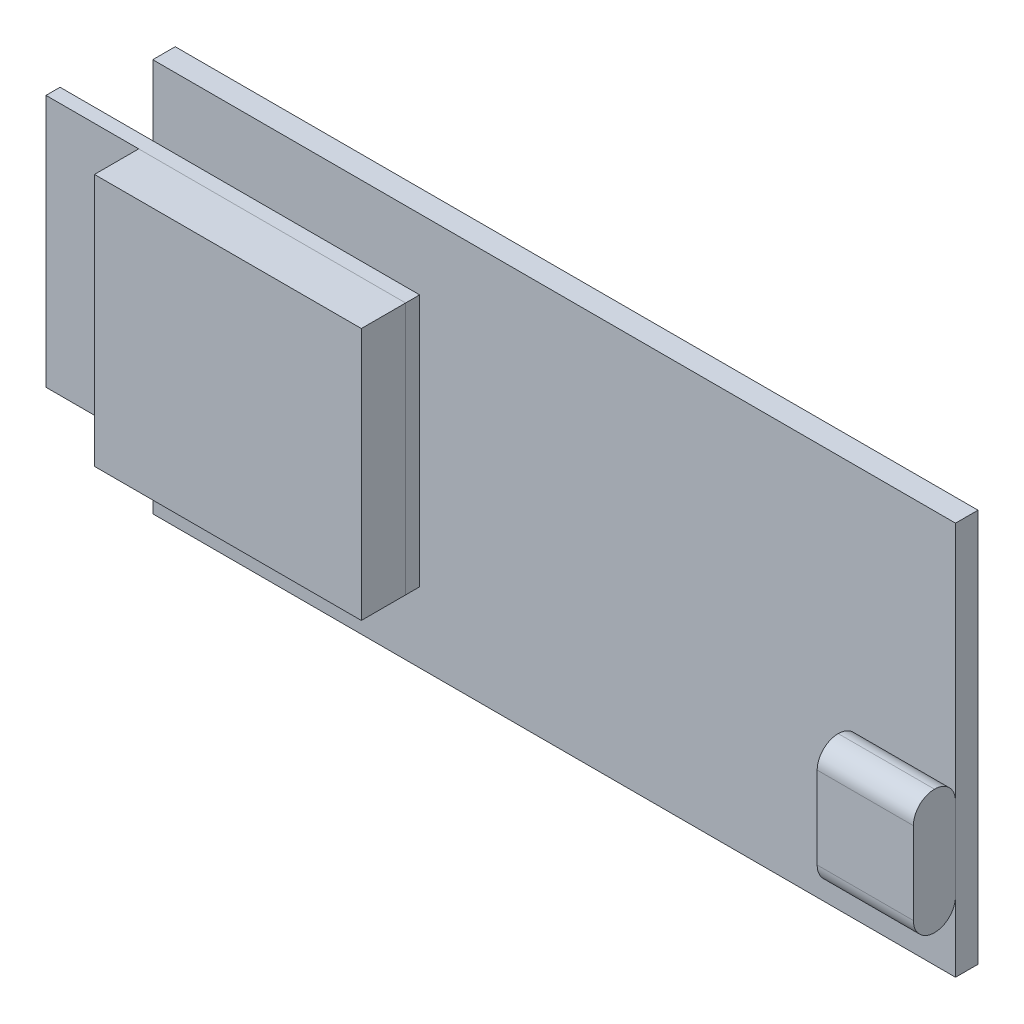
ISO-10303-21;
HEADER;
FILE_DESCRIPTION(('STEP AP214'),'2;1');
FILE_NAME('part.step','',(''),(''),'','','');
FILE_SCHEMA(('AUTOMOTIVE_DESIGN { 1 0 10303 214 1 1 1 1 }'));
ENDSEC;
DATA;
#1=APPLICATION_CONTEXT('core data for automotive mechanical design processes');
#2=APPLICATION_PROTOCOL_DEFINITION('international standard','automotive_design',2000,#1);
#3=PRODUCT_CONTEXT('',#1,'mechanical');
#4=PRODUCT('Part','Part','',(#3));
#5=PRODUCT_RELATED_PRODUCT_CATEGORY('part','',(#4));
#6=PRODUCT_DEFINITION_FORMATION('','',#4);
#7=PRODUCT_DEFINITION_CONTEXT('part definition',#1,'design');
#8=PRODUCT_DEFINITION('design','',#6,#7);
#9=PRODUCT_DEFINITION_SHAPE('','',#8);
#10=(LENGTH_UNIT() NAMED_UNIT(*) SI_UNIT(.MILLI.,.METRE.));
#11=(NAMED_UNIT(*) PLANE_ANGLE_UNIT() SI_UNIT($,.RADIAN.));
#12=(NAMED_UNIT(*) SI_UNIT($,.STERADIAN.) SOLID_ANGLE_UNIT());
#13=UNCERTAINTY_MEASURE_WITH_UNIT(LENGTH_MEASURE(1.E-05),#10,'distance_accuracy_value','');
#14=(GEOMETRIC_REPRESENTATION_CONTEXT(3) GLOBAL_UNCERTAINTY_ASSIGNED_CONTEXT((#13)) GLOBAL_UNIT_ASSIGNED_CONTEXT((#10,
#11,#12)) REPRESENTATION_CONTEXT('',''));
#15=CARTESIAN_POINT('',(0.,0.,0.));
#16=DIRECTION('',(0.,0.,1.));
#17=DIRECTION('',(1.,0.,0.));
#18=AXIS2_PLACEMENT_3D('',#15,#16,#17);
#19=CARTESIAN_POINT('',(-1188.01302911339,0.,5.75));
#20=DIRECTION('',(-1.,0.,0.));
#21=DIRECTION('',(0.,0.,1.));
#22=AXIS2_PLACEMENT_3D('',#19,#20,#21);
#23=PLANE('',#22);
#24=DIRECTION('',(0.,1.,0.));
#25=VECTOR('',#24,1.);
#26=CARTESIAN_POINT('',(-1188.01302911339,0.,2.6));
#27=LINE('',#26,#25);
#28=CARTESIAN_POINT('',(-1188.01302911339,907.997058044656,2.6));
#29=VERTEX_POINT('',#28);
#30=CARTESIAN_POINT('',(-1188.01302911339,925.997058044657,2.6));
#31=VERTEX_POINT('',#30);
#32=EDGE_CURVE('E114',#29,#31,#27,.T.);
#33=ORIENTED_EDGE('',*,*,#32,.T.);
#34=DIRECTION('',(0.,0.,-1.));
#35=VECTOR('',#34,1.);
#36=CARTESIAN_POINT('',(-1188.01302911339,925.997058044657,5.75));
#37=LINE('',#36,#35);
#38=CARTESIAN_POINT('',(-1188.01302911339,925.997058044657,5.75));
#39=VERTEX_POINT('',#38);
#40=EDGE_CURVE('E12',#39,#31,#37,.T.);
#41=ORIENTED_EDGE('',*,*,#40,.F.);
#42=DIRECTION('',(0.,1.,0.));
#43=VECTOR('',#42,1.);
#44=CARTESIAN_POINT('',(-1188.01302911339,0.,5.75));
#45=LINE('',#44,#43);
#46=CARTESIAN_POINT('',(-1188.01302911339,907.997058044656,5.75));
#47=VERTEX_POINT('',#46);
#48=EDGE_CURVE('E91',#47,#39,#45,.T.);
#49=ORIENTED_EDGE('',*,*,#48,.F.);
#50=DIRECTION('',(0.,0.,-1.));
#51=VECTOR('',#50,1.);
#52=CARTESIAN_POINT('',(-1188.01302911339,907.997058044656,5.75));
#53=LINE('',#52,#51);
#54=EDGE_CURVE('E110',#47,#29,#53,.T.);
#55=ORIENTED_EDGE('',*,*,#54,.T.);
#56=EDGE_LOOP('',(#33,#41,#49,#55));
#57=FACE_BOUND('',#56,.T.);
#58=ADVANCED_FACE('F52',(#57),#23,.F.);
#59=CARTESIAN_POINT('',(0.,925.997058044657,5.75));
#60=DIRECTION('',(0.,1.,0.));
#61=DIRECTION('',(0.,0.,1.));
#62=AXIS2_PLACEMENT_3D('',#59,#60,#61);
#63=PLANE('',#62);
#64=DIRECTION('',(1.,0.,0.));
#65=VECTOR('',#64,1.);
#66=CARTESIAN_POINT('',(0.,925.997058044657,2.6));
#67=LINE('',#66,#65);
#68=CARTESIAN_POINT('',(-1207.01302911339,925.997058044657,2.6));
#69=VERTEX_POINT('',#68);
#70=EDGE_CURVE('E100',#69,#31,#67,.T.);
#71=ORIENTED_EDGE('',*,*,#70,.F.);
#72=DIRECTION('',(0.,0.,-1.));
#73=VECTOR('',#72,1.);
#74=CARTESIAN_POINT('',(-1207.01302911339,925.997058044657,5.75));
#75=LINE('',#74,#73);
#76=CARTESIAN_POINT('',(-1207.01302911339,925.997058044657,5.75));
#77=VERTEX_POINT('',#76);
#78=EDGE_CURVE('E60',#77,#69,#75,.T.);
#79=ORIENTED_EDGE('',*,*,#78,.F.);
#80=DIRECTION('',(1.,0.,0.));
#81=VECTOR('',#80,1.);
#82=CARTESIAN_POINT('',(0.,925.997058044657,5.75));
#83=LINE('',#82,#81);
#84=EDGE_CURVE('E98',#77,#39,#83,.T.);
#85=ORIENTED_EDGE('',*,*,#84,.T.);
#86=ORIENTED_EDGE('',*,*,#40,.T.);
#87=EDGE_LOOP('',(#71,#79,#85,#86));
#88=FACE_BOUND('',#87,.T.);
#89=ADVANCED_FACE('F97',(#88),#63,.T.);
#90=CARTESIAN_POINT('',(-1207.01302911339,0.,5.75));
#91=DIRECTION('',(-1.,0.,0.));
#92=DIRECTION('',(0.,0.,1.));
#93=AXIS2_PLACEMENT_3D('',#90,#91,#92);
#94=PLANE('',#93);
#95=DIRECTION('',(0.,1.,0.));
#96=VECTOR('',#95,1.);
#97=CARTESIAN_POINT('',(-1207.01302911339,0.,2.6));
#98=LINE('',#97,#96);
#99=CARTESIAN_POINT('',(-1207.01302911339,907.997058044656,2.6));
#100=VERTEX_POINT('',#99);
#101=EDGE_CURVE('E118',#100,#69,#98,.T.);
#102=ORIENTED_EDGE('',*,*,#101,.F.);
#103=DIRECTION('',(0.,0.,-1.));
#104=VECTOR('',#103,1.);
#105=CARTESIAN_POINT('',(-1207.01302911339,907.997058044656,5.75));
#106=LINE('',#105,#104);
#107=CARTESIAN_POINT('',(-1207.01302911339,907.997058044656,5.75));
#108=VERTEX_POINT('',#107);
#109=EDGE_CURVE('E83',#108,#100,#106,.T.);
#110=ORIENTED_EDGE('',*,*,#109,.F.);
#111=DIRECTION('',(0.,1.,0.));
#112=VECTOR('',#111,1.);
#113=CARTESIAN_POINT('',(-1207.01302911339,0.,5.75));
#114=LINE('',#113,#112);
#115=EDGE_CURVE('E106',#108,#77,#114,.T.);
#116=ORIENTED_EDGE('',*,*,#115,.T.);
#117=ORIENTED_EDGE('',*,*,#78,.T.);
#118=EDGE_LOOP('',(#102,#110,#116,#117));
#119=FACE_BOUND('',#118,.T.);
#120=ADVANCED_FACE('F108',(#119),#94,.T.);
#121=CARTESIAN_POINT('',(-5.30568021122682E-12,907.997058044664,5.75));
#122=DIRECTION('',(0.,1.,0.));
#123=DIRECTION('',(-1.,0.,0.));
#124=AXIS2_PLACEMENT_3D('',#121,#122,#123);
#125=PLANE('',#124);
#126=DIRECTION('',(1.,0.,0.));
#127=VECTOR('',#126,1.);
#128=CARTESIAN_POINT('',(-5.30568021122682E-12,907.997058044664,2.6));
#129=LINE('',#128,#127);
#130=EDGE_CURVE('E86',#100,#29,#129,.T.);
#131=ORIENTED_EDGE('',*,*,#130,.T.);
#132=ORIENTED_EDGE('',*,*,#54,.F.);
#133=DIRECTION('',(1.,0.,0.));
#134=VECTOR('',#133,1.);
#135=CARTESIAN_POINT('',(-5.30568021122682E-12,907.997058044664,5.75));
#136=LINE('',#135,#134);
#137=EDGE_CURVE('E68',#108,#47,#136,.T.);
#138=ORIENTED_EDGE('',*,*,#137,.F.);
#139=ORIENTED_EDGE('',*,*,#109,.T.);
#140=EDGE_LOOP('',(#131,#132,#138,#139));
#141=FACE_BOUND('',#140,.T.);
#142=ADVANCED_FACE('F131',(#141),#125,.F.);
#143=CARTESIAN_POINT('',(0.,0.,5.75));
#144=DIRECTION('',(0.,0.,-1.));
#145=DIRECTION('',(-1.,0.,0.));
#146=AXIS2_PLACEMENT_3D('',#143,#144,#145);
#147=PLANE('',#146);
#148=ORIENTED_EDGE('',*,*,#48,.T.);
#149=ORIENTED_EDGE('',*,*,#84,.F.);
#150=ORIENTED_EDGE('',*,*,#115,.F.);
#151=ORIENTED_EDGE('',*,*,#137,.T.);
#152=EDGE_LOOP('',(#148,#149,#150,#151));
#153=FACE_BOUND('',#152,.T.);
#154=ADVANCED_FACE('F105',(#153),#147,.F.);
#155=CARTESIAN_POINT('',(0.,0.,2.6));
#156=DIRECTION('',(0.,0.,-1.));
#157=DIRECTION('',(-1.,0.,0.));
#158=AXIS2_PLACEMENT_3D('',#155,#156,#157);
#159=PLANE('',#158);
#160=ORIENTED_EDGE('',*,*,#32,.F.);
#161=ORIENTED_EDGE('',*,*,#130,.F.);
#162=ORIENTED_EDGE('',*,*,#101,.T.);
#163=ORIENTED_EDGE('',*,*,#70,.T.);
#164=EDGE_LOOP('',(#160,#161,#162,#163));
#165=FACE_BOUND('',#164,.T.);
#166=ADVANCED_FACE('F125',(#165),#159,.T.);
#167=CLOSED_SHELL('',(#58,#89,#120,#142,#154,#166));
#168=MANIFOLD_SOLID_BREP('B2',#167);
#169=CARTESIAN_POINT('',(-1188.01302911339,0.,2.6));
#170=DIRECTION('',(-1.,0.,0.));
#171=DIRECTION('',(0.,0.,1.));
#172=AXIS2_PLACEMENT_3D('',#169,#170,#171);
#173=PLANE('',#172);
#174=DIRECTION('',(0.,1.,0.));
#175=VECTOR('',#174,1.);
#176=CARTESIAN_POINT('',(-1188.01302911339,0.,1.6));
#177=LINE('',#176,#175);
#178=CARTESIAN_POINT('',(-1188.01302911339,907.997058044656,1.6));
#179=VERTEX_POINT('',#178);
#180=CARTESIAN_POINT('',(-1188.01302911339,925.997058044657,1.6));
#181=VERTEX_POINT('',#180);
#182=EDGE_CURVE('E248',#179,#181,#177,.T.);
#183=ORIENTED_EDGE('',*,*,#182,.T.);
#184=DIRECTION('',(0.,0.,-1.));
#185=VECTOR('',#184,1.);
#186=CARTESIAN_POINT('',(-1188.01302911339,925.997058044657,2.6));
#187=LINE('',#186,#185);
#188=CARTESIAN_POINT('',(-1188.01302911339,925.997058044657,2.6));
#189=VERTEX_POINT('',#188);
#190=EDGE_CURVE('E50',#189,#181,#187,.T.);
#191=ORIENTED_EDGE('',*,*,#190,.F.);
#192=DIRECTION('',(0.,1.,0.));
#193=VECTOR('',#192,1.);
#194=CARTESIAN_POINT('',(-1188.01302911339,0.,2.6));
#195=LINE('',#194,#193);
#196=CARTESIAN_POINT('',(-1188.01302911339,907.997058044656,2.6));
#197=VERTEX_POINT('',#196);
#198=EDGE_CURVE('E225',#197,#189,#195,.T.);
#199=ORIENTED_EDGE('',*,*,#198,.F.);
#200=DIRECTION('',(0.,0.,-1.));
#201=VECTOR('',#200,1.);
#202=CARTESIAN_POINT('',(-1188.01302911339,907.997058044656,2.6));
#203=LINE('',#202,#201);
#204=EDGE_CURVE('E244',#197,#179,#203,.T.);
#205=ORIENTED_EDGE('',*,*,#204,.T.);
#206=EDGE_LOOP('',(#183,#191,#199,#205));
#207=FACE_BOUND('',#206,.T.);
#208=ADVANCED_FACE('F186',(#207),#173,.F.);
#209=CARTESIAN_POINT('',(0.,925.997058044657,2.6));
#210=DIRECTION('',(0.,1.,0.));
#211=DIRECTION('',(0.,0.,1.));
#212=AXIS2_PLACEMENT_3D('',#209,#210,#211);
#213=PLANE('',#212);
#214=DIRECTION('',(1.,0.,0.));
#215=VECTOR('',#214,1.);
#216=CARTESIAN_POINT('',(0.,925.997058044657,1.6));
#217=LINE('',#216,#215);
#218=CARTESIAN_POINT('',(-1213.61302911339,925.997058044657,1.6));
#219=VERTEX_POINT('',#218);
#220=EDGE_CURVE('E234',#219,#181,#217,.T.);
#221=ORIENTED_EDGE('',*,*,#220,.F.);
#222=DIRECTION('',(0.,0.,-1.));
#223=VECTOR('',#222,1.);
#224=CARTESIAN_POINT('',(-1213.61302911339,925.997058044657,2.6));
#225=LINE('',#224,#223);
#226=CARTESIAN_POINT('',(-1213.61302911339,925.997058044657,2.6));
#227=VERTEX_POINT('',#226);
#228=EDGE_CURVE('E194',#227,#219,#225,.T.);
#229=ORIENTED_EDGE('',*,*,#228,.F.);
#230=DIRECTION('',(1.,0.,0.));
#231=VECTOR('',#230,1.);
#232=CARTESIAN_POINT('',(0.,925.997058044657,2.6));
#233=LINE('',#232,#231);
#234=EDGE_CURVE('E232',#227,#189,#233,.T.);
#235=ORIENTED_EDGE('',*,*,#234,.T.);
#236=ORIENTED_EDGE('',*,*,#190,.T.);
#237=EDGE_LOOP('',(#221,#229,#235,#236));
#238=FACE_BOUND('',#237,.T.);
#239=ADVANCED_FACE('F231',(#238),#213,.T.);
#240=CARTESIAN_POINT('',(-1213.61302911339,0.,2.6));
#241=DIRECTION('',(-1.,0.,0.));
#242=DIRECTION('',(0.,0.,1.));
#243=AXIS2_PLACEMENT_3D('',#240,#241,#242);
#244=PLANE('',#243);
#245=DIRECTION('',(0.,1.,0.));
#246=VECTOR('',#245,1.);
#247=CARTESIAN_POINT('',(-1213.61302911339,0.,1.6));
#248=LINE('',#247,#246);
#249=CARTESIAN_POINT('',(-1213.61302911339,907.997058044656,1.6));
#250=VERTEX_POINT('',#249);
#251=EDGE_CURVE('E252',#250,#219,#248,.T.);
#252=ORIENTED_EDGE('',*,*,#251,.F.);
#253=DIRECTION('',(0.,0.,-1.));
#254=VECTOR('',#253,1.);
#255=CARTESIAN_POINT('',(-1213.61302911339,907.997058044656,2.6));
#256=LINE('',#255,#254);
#257=CARTESIAN_POINT('',(-1213.61302911339,907.997058044656,2.6));
#258=VERTEX_POINT('',#257);
#259=EDGE_CURVE('E217',#258,#250,#256,.T.);
#260=ORIENTED_EDGE('',*,*,#259,.F.);
#261=DIRECTION('',(0.,1.,0.));
#262=VECTOR('',#261,1.);
#263=CARTESIAN_POINT('',(-1213.61302911339,0.,2.6));
#264=LINE('',#263,#262);
#265=EDGE_CURVE('E240',#258,#227,#264,.T.);
#266=ORIENTED_EDGE('',*,*,#265,.T.);
#267=ORIENTED_EDGE('',*,*,#228,.T.);
#268=EDGE_LOOP('',(#252,#260,#266,#267));
#269=FACE_BOUND('',#268,.T.);
#270=ADVANCED_FACE('F242',(#269),#244,.T.);
#271=CARTESIAN_POINT('',(1.52739278808041E-11,907.997058044636,2.6));
#272=DIRECTION('',(0.,1.,0.));
#273=DIRECTION('',(-1.,0.,0.));
#274=AXIS2_PLACEMENT_3D('',#271,#272,#273);
#275=PLANE('',#274);
#276=DIRECTION('',(1.,0.,0.));
#277=VECTOR('',#276,1.);
#278=CARTESIAN_POINT('',(1.52739278808041E-11,907.997058044636,1.6));
#279=LINE('',#278,#277);
#280=EDGE_CURVE('E220',#250,#179,#279,.T.);
#281=ORIENTED_EDGE('',*,*,#280,.T.);
#282=ORIENTED_EDGE('',*,*,#204,.F.);
#283=DIRECTION('',(1.,0.,0.));
#284=VECTOR('',#283,1.);
#285=CARTESIAN_POINT('',(1.52739278808041E-11,907.997058044636,2.6));
#286=LINE('',#285,#284);
#287=EDGE_CURVE('E202',#258,#197,#286,.T.);
#288=ORIENTED_EDGE('',*,*,#287,.F.);
#289=ORIENTED_EDGE('',*,*,#259,.T.);
#290=EDGE_LOOP('',(#281,#282,#288,#289));
#291=FACE_BOUND('',#290,.T.);
#292=ADVANCED_FACE('F265',(#291),#275,.F.);
#293=CARTESIAN_POINT('',(0.,0.,2.6));
#294=DIRECTION('',(0.,0.,-1.));
#295=DIRECTION('',(-1.,0.,0.));
#296=AXIS2_PLACEMENT_3D('',#293,#294,#295);
#297=PLANE('',#296);
#298=ORIENTED_EDGE('',*,*,#198,.T.);
#299=ORIENTED_EDGE('',*,*,#234,.F.);
#300=ORIENTED_EDGE('',*,*,#265,.F.);
#301=ORIENTED_EDGE('',*,*,#287,.T.);
#302=EDGE_LOOP('',(#298,#299,#300,#301));
#303=FACE_BOUND('',#302,.T.);
#304=ADVANCED_FACE('F239',(#303),#297,.F.);
#305=CARTESIAN_POINT('',(0.,0.,1.6));
#306=DIRECTION('',(0.,0.,-1.));
#307=DIRECTION('',(-1.,0.,0.));
#308=AXIS2_PLACEMENT_3D('',#305,#306,#307);
#309=PLANE('',#308);
#310=ORIENTED_EDGE('',*,*,#182,.F.);
#311=ORIENTED_EDGE('',*,*,#280,.F.);
#312=ORIENTED_EDGE('',*,*,#251,.T.);
#313=ORIENTED_EDGE('',*,*,#220,.T.);
#314=EDGE_LOOP('',(#310,#311,#312,#313));
#315=FACE_BOUND('',#314,.T.);
#316=ADVANCED_FACE('F259',(#315),#309,.T.);
#317=CLOSED_SHELL('',(#208,#239,#270,#292,#304,#316));
#318=MANIFOLD_SOLID_BREP('B6',#317);
#319=CARTESIAN_POINT('',(-1149.86302911339,0.,4.6));
#320=DIRECTION('',(-1.,0.,0.));
#321=DIRECTION('',(0.,0.,1.));
#322=AXIS2_PLACEMENT_3D('',#319,#320,#321);
#323=PLANE('',#322);
#324=DIRECTION('',(0.,1.,0.));
#325=VECTOR('',#324,1.);
#326=CARTESIAN_POINT('',(-1149.86302911339,0.,1.6));
#327=LINE('',#326,#325);
#328=CARTESIAN_POINT('',(-1149.86302911339,907.997058044656,1.6));
#329=VERTEX_POINT('',#328);
#330=CARTESIAN_POINT('',(-1149.86302911339,913.847058044656,1.6));
#331=VERTEX_POINT('',#330);
#332=EDGE_CURVE('E399',#329,#331,#327,.T.);
#333=ORIENTED_EDGE('',*,*,#332,.T.);
#334=CARTESIAN_POINT('',(-1149.86302911339,913.847058044656,3.1));
#335=DIRECTION('',(-1.,0.,0.));
#336=DIRECTION('',(0.,0.,1.));
#337=AXIS2_PLACEMENT_3D('',#334,#335,#336);
#338=CIRCLE('',#337,1.5);
#339=CARTESIAN_POINT('',(-1149.86302911339,915.347058044656,3.1));
#340=VERTEX_POINT('',#339);
#341=EDGE_CURVE('E420',#331,#340,#338,.F.);
#342=ORIENTED_EDGE('',*,*,#341,.T.);
#343=CARTESIAN_POINT('',(-1149.86302911339,913.847058044656,3.1));
#344=DIRECTION('',(-1.,0.,0.));
#345=DIRECTION('',(0.,0.,1.));
#346=AXIS2_PLACEMENT_3D('',#343,#344,#345);
#347=CIRCLE('',#346,1.5);
#348=CARTESIAN_POINT('',(-1149.86302911339,913.847058044656,4.6));
#349=VERTEX_POINT('',#348);
#350=EDGE_CURVE('E348',#340,#349,#347,.F.);
#351=ORIENTED_EDGE('',*,*,#350,.T.);
#352=DIRECTION('',(0.,1.,0.));
#353=VECTOR('',#352,1.);
#354=CARTESIAN_POINT('',(-1149.86302911339,0.,4.6));
#355=LINE('',#354,#353);
#356=CARTESIAN_POINT('',(-1149.86302911339,907.997058044656,4.6));
#357=VERTEX_POINT('',#356);
#358=EDGE_CURVE('E409',#357,#349,#355,.T.);
#359=ORIENTED_EDGE('',*,*,#358,.F.);
#360=CARTESIAN_POINT('',(-1149.86302911339,907.997058044656,3.1));
#361=DIRECTION('',(-1.,0.,0.));
#362=DIRECTION('',(0.,0.,1.));
#363=AXIS2_PLACEMENT_3D('',#360,#361,#362);
#364=CIRCLE('',#363,1.5);
#365=CARTESIAN_POINT('',(-1149.86302911339,906.497058044656,3.1));
#366=VERTEX_POINT('',#365);
#367=EDGE_CURVE('E342',#357,#366,#364,.F.);
#368=ORIENTED_EDGE('',*,*,#367,.T.);
#369=CARTESIAN_POINT('',(-1149.86302911339,907.997058044656,3.1));
#370=DIRECTION('',(-1.,0.,0.));
#371=DIRECTION('',(0.,0.,1.));
#372=AXIS2_PLACEMENT_3D('',#369,#370,#371);
#373=CIRCLE('',#372,1.5);
#374=EDGE_CURVE('E417',#366,#329,#373,.F.);
#375=ORIENTED_EDGE('',*,*,#374,.T.);
#376=EDGE_LOOP('',(#333,#342,#351,#359,#368,#375));
#377=FACE_BOUND('',#376,.T.);
#378=ADVANCED_FACE('F325',(#377),#323,.F.);
#379=CARTESIAN_POINT('',(-1156.71302911339,0.,4.6));
#380=DIRECTION('',(-1.,0.,0.));
#381=DIRECTION('',(0.,0.,1.));
#382=AXIS2_PLACEMENT_3D('',#379,#380,#381);
#383=PLANE('',#382);
#384=CARTESIAN_POINT('',(-1156.71302911339,913.847058044656,3.1));
#385=DIRECTION('',(-1.,0.,0.));
#386=DIRECTION('',(0.,0.,1.));
#387=AXIS2_PLACEMENT_3D('',#384,#385,#386);
#388=CIRCLE('',#387,1.5);
#389=CARTESIAN_POINT('',(-1156.71302911339,913.847058044656,4.6));
#390=VERTEX_POINT('',#389);
#391=CARTESIAN_POINT('',(-1156.71302911339,915.347058044656,3.1));
#392=VERTEX_POINT('',#391);
#393=EDGE_CURVE('E388',#390,#392,#388,.T.);
#394=ORIENTED_EDGE('',*,*,#393,.T.);
#395=CARTESIAN_POINT('',(-1156.71302911339,913.847058044656,3.1));
#396=DIRECTION('',(-1.,0.,0.));
#397=DIRECTION('',(0.,0.,1.));
#398=AXIS2_PLACEMENT_3D('',#395,#396,#397);
#399=CIRCLE('',#398,1.5);
#400=CARTESIAN_POINT('',(-1156.71302911339,913.847058044656,1.6));
#401=VERTEX_POINT('',#400);
#402=EDGE_CURVE('E404',#392,#401,#399,.T.);
#403=ORIENTED_EDGE('',*,*,#402,.T.);
#404=DIRECTION('',(0.,1.,0.));
#405=VECTOR('',#404,1.);
#406=CARTESIAN_POINT('',(-1156.71302911339,0.,1.6));
#407=LINE('',#406,#405);
#408=CARTESIAN_POINT('',(-1156.71302911339,907.997058044656,1.6));
#409=VERTEX_POINT('',#408);
#410=EDGE_CURVE('E396',#409,#401,#407,.T.);
#411=ORIENTED_EDGE('',*,*,#410,.F.);
#412=CARTESIAN_POINT('',(-1156.71302911339,907.997058044656,3.1));
#413=DIRECTION('',(-1.,0.,0.));
#414=DIRECTION('',(0.,0.,1.));
#415=AXIS2_PLACEMENT_3D('',#412,#413,#414);
#416=CIRCLE('',#415,1.5);
#417=CARTESIAN_POINT('',(-1156.71302911339,906.497058044656,3.1));
#418=VERTEX_POINT('',#417);
#419=EDGE_CURVE('E379',#409,#418,#416,.T.);
#420=ORIENTED_EDGE('',*,*,#419,.T.);
#421=CARTESIAN_POINT('',(-1156.71302911339,907.997058044656,3.1));
#422=DIRECTION('',(-1.,0.,0.));
#423=DIRECTION('',(0.,0.,1.));
#424=AXIS2_PLACEMENT_3D('',#421,#422,#423);
#425=CIRCLE('',#424,1.5);
#426=CARTESIAN_POINT('',(-1156.71302911339,907.997058044656,4.6));
#427=VERTEX_POINT('',#426);
#428=EDGE_CURVE('E389',#418,#427,#425,.T.);
#429=ORIENTED_EDGE('',*,*,#428,.T.);
#430=DIRECTION('',(0.,1.,0.));
#431=VECTOR('',#430,1.);
#432=CARTESIAN_POINT('',(-1156.71302911339,0.,4.6));
#433=LINE('',#432,#431);
#434=EDGE_CURVE('E406',#427,#390,#433,.T.);
#435=ORIENTED_EDGE('',*,*,#434,.T.);
#436=EDGE_LOOP('',(#394,#403,#411,#420,#429,#435));
#437=FACE_BOUND('',#436,.T.);
#438=ADVANCED_FACE('F402',(#437),#383,.T.);
#439=CARTESIAN_POINT('',(0.,0.,4.6));
#440=DIRECTION('',(0.,0.,-1.));
#441=DIRECTION('',(-1.,0.,0.));
#442=AXIS2_PLACEMENT_3D('',#439,#440,#441);
#443=PLANE('',#442);
#444=ORIENTED_EDGE('',*,*,#358,.T.);
#445=DIRECTION('',(-1.,0.,0.));
#446=VECTOR('',#445,1.);
#447=CARTESIAN_POINT('',(0.,913.847058044656,4.6));
#448=LINE('',#447,#446);
#449=EDGE_CURVE('E184',#349,#390,#448,.T.);
#450=ORIENTED_EDGE('',*,*,#449,.T.);
#451=ORIENTED_EDGE('',*,*,#434,.F.);
#452=DIRECTION('',(-1.,0.,0.));
#453=VECTOR('',#452,1.);
#454=CARTESIAN_POINT('',(-1149.86302911339,907.997058044656,4.6));
#455=LINE('',#454,#453);
#456=EDGE_CURVE('E334',#427,#357,#455,.F.);
#457=ORIENTED_EDGE('',*,*,#456,.T.);
#458=EDGE_LOOP('',(#444,#450,#451,#457));
#459=FACE_BOUND('',#458,.T.);
#460=ADVANCED_FACE('F425',(#459),#443,.F.);
#461=CARTESIAN_POINT('',(0.,0.,1.6));
#462=DIRECTION('',(0.,0.,-1.));
#463=DIRECTION('',(-1.,0.,0.));
#464=AXIS2_PLACEMENT_3D('',#461,#462,#463);
#465=PLANE('',#464);
#466=ORIENTED_EDGE('',*,*,#332,.F.);
#467=DIRECTION('',(-1.,0.,0.));
#468=VECTOR('',#467,1.);
#469=CARTESIAN_POINT('',(0.,907.997058044656,1.6));
#470=LINE('',#469,#468);
#471=EDGE_CURVE('E383',#329,#409,#470,.T.);
#472=ORIENTED_EDGE('',*,*,#471,.T.);
#473=ORIENTED_EDGE('',*,*,#410,.T.);
#474=DIRECTION('',(-1.,0.,0.));
#475=VECTOR('',#474,1.);
#476=CARTESIAN_POINT('',(-1149.86302911339,913.847058044656,1.6));
#477=LINE('',#476,#475);
#478=EDGE_CURVE('E400',#401,#331,#477,.F.);
#479=ORIENTED_EDGE('',*,*,#478,.T.);
#480=EDGE_LOOP('',(#466,#472,#473,#479));
#481=FACE_BOUND('',#480,.T.);
#482=ADVANCED_FACE('F394',(#481),#465,.T.);
#483=CARTESIAN_POINT('',(0.,907.997058044656,3.1));
#484=DIRECTION('',(1.,0.,0.));
#485=DIRECTION('',(0.,0.,-1.));
#486=AXIS2_PLACEMENT_3D('',#483,#484,#485);
#487=CYLINDRICAL_SURFACE('',#486,1.5);
#488=DIRECTION('',(-1.,0.,0.));
#489=VECTOR('',#488,1.);
#490=CARTESIAN_POINT('',(-1156.71302911339,906.497058044656,3.1));
#491=LINE('',#490,#489);
#492=EDGE_CURVE('E384',#366,#418,#491,.T.);
#493=ORIENTED_EDGE('',*,*,#492,.F.);
#494=ORIENTED_EDGE('',*,*,#367,.F.);
#495=ORIENTED_EDGE('',*,*,#456,.F.);
#496=ORIENTED_EDGE('',*,*,#428,.F.);
#497=EDGE_LOOP('',(#493,#494,#495,#496));
#498=FACE_BOUND('',#497,.T.);
#499=ADVANCED_FACE('F429',(#498),#487,.T.);
#500=CARTESIAN_POINT('',(0.,907.997058044656,3.1));
#501=DIRECTION('',(-1.,0.,0.));
#502=DIRECTION('',(0.,0.,1.));
#503=AXIS2_PLACEMENT_3D('',#500,#501,#502);
#504=CYLINDRICAL_SURFACE('',#503,1.5);
#505=ORIENTED_EDGE('',*,*,#374,.F.);
#506=ORIENTED_EDGE('',*,*,#492,.T.);
#507=ORIENTED_EDGE('',*,*,#419,.F.);
#508=ORIENTED_EDGE('',*,*,#471,.F.);
#509=EDGE_LOOP('',(#505,#506,#507,#508));
#510=FACE_BOUND('',#509,.T.);
#511=ADVANCED_FACE('F382',(#510),#504,.T.);
#512=CARTESIAN_POINT('',(0.,913.847058044656,3.1));
#513=DIRECTION('',(-1.,0.,0.));
#514=DIRECTION('',(0.,0.,1.));
#515=AXIS2_PLACEMENT_3D('',#512,#513,#514);
#516=CYLINDRICAL_SURFACE('',#515,1.5);
#517=ORIENTED_EDGE('',*,*,#449,.F.);
#518=ORIENTED_EDGE('',*,*,#350,.F.);
#519=DIRECTION('',(-1.,0.,0.));
#520=VECTOR('',#519,1.);
#521=CARTESIAN_POINT('',(0.,915.347058044656,3.1));
#522=LINE('',#521,#520);
#523=EDGE_CURVE('E329',#392,#340,#522,.F.);
#524=ORIENTED_EDGE('',*,*,#523,.F.);
#525=ORIENTED_EDGE('',*,*,#393,.F.);
#526=EDGE_LOOP('',(#517,#518,#524,#525));
#527=FACE_BOUND('',#526,.T.);
#528=ADVANCED_FACE('F327',(#527),#516,.T.);
#529=CARTESIAN_POINT('',(0.,913.847058044656,3.1));
#530=DIRECTION('',(1.,0.,0.));
#531=DIRECTION('',(0.,0.,-1.));
#532=AXIS2_PLACEMENT_3D('',#529,#530,#531);
#533=CYLINDRICAL_SURFACE('',#532,1.5);
#534=ORIENTED_EDGE('',*,*,#341,.F.);
#535=ORIENTED_EDGE('',*,*,#478,.F.);
#536=ORIENTED_EDGE('',*,*,#402,.F.);
#537=ORIENTED_EDGE('',*,*,#523,.T.);
#538=EDGE_LOOP('',(#534,#535,#536,#537));
#539=FACE_BOUND('',#538,.T.);
#540=ADVANCED_FACE('F435',(#539),#533,.T.);
#541=CLOSED_SHELL('',(#378,#438,#460,#482,#499,#511,#528,#540));
#542=MANIFOLD_SOLID_BREP('B44',#541);
#543=CARTESIAN_POINT('',(-1207.01302911339,902.997058044656,1.6));
#544=DIRECTION('',(-1.,0.,0.));
#545=DIRECTION('',(0.,0.,1.));
#546=AXIS2_PLACEMENT_3D('',#543,#544,#545);
#547=PLANE('',#546);
#548=DIRECTION('',(0.,1.,0.));
#549=VECTOR('',#548,1.);
#550=CARTESIAN_POINT('',(-1207.01302911339,902.997058044656,0.));
#551=LINE('',#550,#549);
#552=CARTESIAN_POINT('',(-1207.01302911339,902.997058044656,0.));
#553=VERTEX_POINT('',#552);
#554=CARTESIAN_POINT('',(-1207.01302911339,930.997058044656,0.));
#555=VERTEX_POINT('',#554);
#556=EDGE_CURVE('E566',#553,#555,#551,.T.);
#557=ORIENTED_EDGE('',*,*,#556,.F.);
#558=DIRECTION('',(0.,0.,-1.));
#559=VECTOR('',#558,1.);
#560=CARTESIAN_POINT('',(-1207.01302911339,902.997058044656,1.6));
#561=LINE('',#560,#559);
#562=CARTESIAN_POINT('',(-1207.01302911339,902.997058044656,1.6));
#563=VERTEX_POINT('',#562);
#564=EDGE_CURVE('E323',#563,#553,#561,.T.);
#565=ORIENTED_EDGE('',*,*,#564,.F.);
#566=DIRECTION('',(0.,1.,0.));
#567=VECTOR('',#566,1.);
#568=CARTESIAN_POINT('',(-1207.01302911339,902.997058044656,1.6));
#569=LINE('',#568,#567);
#570=CARTESIAN_POINT('',(-1207.01302911339,930.997058044656,1.6));
#571=VERTEX_POINT('',#570);
#572=EDGE_CURVE('E561',#563,#571,#569,.T.);
#573=ORIENTED_EDGE('',*,*,#572,.T.);
#574=DIRECTION('',(0.,0.,-1.));
#575=VECTOR('',#574,1.);
#576=CARTESIAN_POINT('',(-1207.01302911339,930.997058044656,1.6));
#577=LINE('',#576,#575);
#578=EDGE_CURVE('E504',#571,#555,#577,.T.);
#579=ORIENTED_EDGE('',*,*,#578,.T.);
#580=EDGE_LOOP('',(#557,#565,#573,#579));
#581=FACE_BOUND('',#580,.T.);
#582=ADVANCED_FACE('F501',(#581),#547,.T.);
#583=CARTESIAN_POINT('',(-1207.01302911339,902.997058044656,1.6));
#584=DIRECTION('',(0.,1.,0.));
#585=DIRECTION('',(0.,0.,1.));
#586=AXIS2_PLACEMENT_3D('',#583,#584,#585);
#587=PLANE('',#586);
#588=DIRECTION('',(1.,0.,0.));
#589=VECTOR('',#588,1.);
#590=CARTESIAN_POINT('',(-1207.01302911339,902.997058044656,0.));
#591=LINE('',#590,#589);
#592=CARTESIAN_POINT('',(-1149.86302911339,902.997058044656,0.));
#593=VERTEX_POINT('',#592);
#594=EDGE_CURVE('E534',#553,#593,#591,.T.);
#595=ORIENTED_EDGE('',*,*,#594,.T.);
#596=DIRECTION('',(0.,0.,-1.));
#597=VECTOR('',#596,1.);
#598=CARTESIAN_POINT('',(-1149.86302911339,902.997058044656,1.6));
#599=LINE('',#598,#597);
#600=CARTESIAN_POINT('',(-1149.86302911339,902.997058044656,1.6));
#601=VERTEX_POINT('',#600);
#602=EDGE_CURVE('E510',#601,#593,#599,.T.);
#603=ORIENTED_EDGE('',*,*,#602,.F.);
#604=DIRECTION('',(1.,0.,0.));
#605=VECTOR('',#604,1.);
#606=CARTESIAN_POINT('',(-1207.01302911339,902.997058044656,1.6));
#607=LINE('',#606,#605);
#608=EDGE_CURVE('E551',#563,#601,#607,.T.);
#609=ORIENTED_EDGE('',*,*,#608,.F.);
#610=ORIENTED_EDGE('',*,*,#564,.T.);
#611=EDGE_LOOP('',(#595,#603,#609,#610));
#612=FACE_BOUND('',#611,.T.);
#613=ADVANCED_FACE('F576',(#612),#587,.F.);
#614=CARTESIAN_POINT('',(-1149.86302911339,902.997058044656,1.6));
#615=DIRECTION('',(-1.,0.,0.));
#616=DIRECTION('',(0.,0.,1.));
#617=AXIS2_PLACEMENT_3D('',#614,#615,#616);
#618=PLANE('',#617);
#619=DIRECTION('',(0.,1.,0.));
#620=VECTOR('',#619,1.);
#621=CARTESIAN_POINT('',(-1149.86302911339,902.997058044656,0.));
#622=LINE('',#621,#620);
#623=CARTESIAN_POINT('',(-1149.86302911339,930.997058044656,0.));
#624=VERTEX_POINT('',#623);
#625=EDGE_CURVE('E558',#593,#624,#622,.T.);
#626=ORIENTED_EDGE('',*,*,#625,.T.);
#627=DIRECTION('',(0.,0.,-1.));
#628=VECTOR('',#627,1.);
#629=CARTESIAN_POINT('',(-1149.86302911339,930.997058044656,1.6));
#630=LINE('',#629,#628);
#631=CARTESIAN_POINT('',(-1149.86302911339,930.997058044656,1.6));
#632=VERTEX_POINT('',#631);
#633=EDGE_CURVE('E555',#632,#624,#630,.T.);
#634=ORIENTED_EDGE('',*,*,#633,.F.);
#635=DIRECTION('',(0.,1.,0.));
#636=VECTOR('',#635,1.);
#637=CARTESIAN_POINT('',(-1149.86302911339,902.997058044656,1.6));
#638=LINE('',#637,#636);
#639=EDGE_CURVE('E546',#601,#632,#638,.T.);
#640=ORIENTED_EDGE('',*,*,#639,.F.);
#641=ORIENTED_EDGE('',*,*,#602,.T.);
#642=EDGE_LOOP('',(#626,#634,#640,#641));
#643=FACE_BOUND('',#642,.T.);
#644=ADVANCED_FACE('F556',(#643),#618,.F.);
#645=CARTESIAN_POINT('',(-1207.01302911339,930.997058044656,1.6));
#646=DIRECTION('',(0.,1.,0.));
#647=DIRECTION('',(0.,0.,1.));
#648=AXIS2_PLACEMENT_3D('',#645,#646,#647);
#649=PLANE('',#648);
#650=DIRECTION('',(1.,0.,0.));
#651=VECTOR('',#650,1.);
#652=CARTESIAN_POINT('',(-1207.01302911339,930.997058044656,0.));
#653=LINE('',#652,#651);
#654=EDGE_CURVE('E569',#555,#624,#653,.T.);
#655=ORIENTED_EDGE('',*,*,#654,.F.);
#656=ORIENTED_EDGE('',*,*,#578,.F.);
#657=DIRECTION('',(1.,0.,0.));
#658=VECTOR('',#657,1.);
#659=CARTESIAN_POINT('',(-1207.01302911339,930.997058044656,1.6));
#660=LINE('',#659,#658);
#661=EDGE_CURVE('E550',#571,#632,#660,.T.);
#662=ORIENTED_EDGE('',*,*,#661,.T.);
#663=ORIENTED_EDGE('',*,*,#633,.T.);
#664=EDGE_LOOP('',(#655,#656,#662,#663));
#665=FACE_BOUND('',#664,.T.);
#666=ADVANCED_FACE('F560',(#665),#649,.T.);
#667=CARTESIAN_POINT('',(0.,0.,1.6));
#668=DIRECTION('',(0.,0.,-1.));
#669=DIRECTION('',(-1.,0.,0.));
#670=AXIS2_PLACEMENT_3D('',#667,#668,#669);
#671=PLANE('',#670);
#672=ORIENTED_EDGE('',*,*,#572,.F.);
#673=ORIENTED_EDGE('',*,*,#608,.T.);
#674=ORIENTED_EDGE('',*,*,#639,.T.);
#675=ORIENTED_EDGE('',*,*,#661,.F.);
#676=EDGE_LOOP('',(#672,#673,#674,#675));
#677=FACE_BOUND('',#676,.T.);
#678=ADVANCED_FACE('F549',(#677),#671,.F.);
#679=CARTESIAN_POINT('',(0.,0.,0.));
#680=DIRECTION('',(0.,0.,-1.));
#681=DIRECTION('',(-1.,0.,0.));
#682=AXIS2_PLACEMENT_3D('',#679,#680,#681);
#683=PLANE('',#682);
#684=ORIENTED_EDGE('',*,*,#556,.T.);
#685=ORIENTED_EDGE('',*,*,#654,.T.);
#686=ORIENTED_EDGE('',*,*,#625,.F.);
#687=ORIENTED_EDGE('',*,*,#594,.F.);
#688=EDGE_LOOP('',(#684,#685,#686,#687));
#689=FACE_BOUND('',#688,.T.);
#690=ADVANCED_FACE('F574',(#689),#683,.T.);
#691=CLOSED_SHELL('',(#582,#613,#644,#666,#678,#690));
#692=MANIFOLD_SOLID_BREP('B178',#691);
#693=ADVANCED_BREP_SHAPE_REPRESENTATION('',(#18,#168,#318,#542,#692),#14);
#694=SHAPE_DEFINITION_REPRESENTATION(#9,#693);
ENDSEC;
END-ISO-10303-21;
